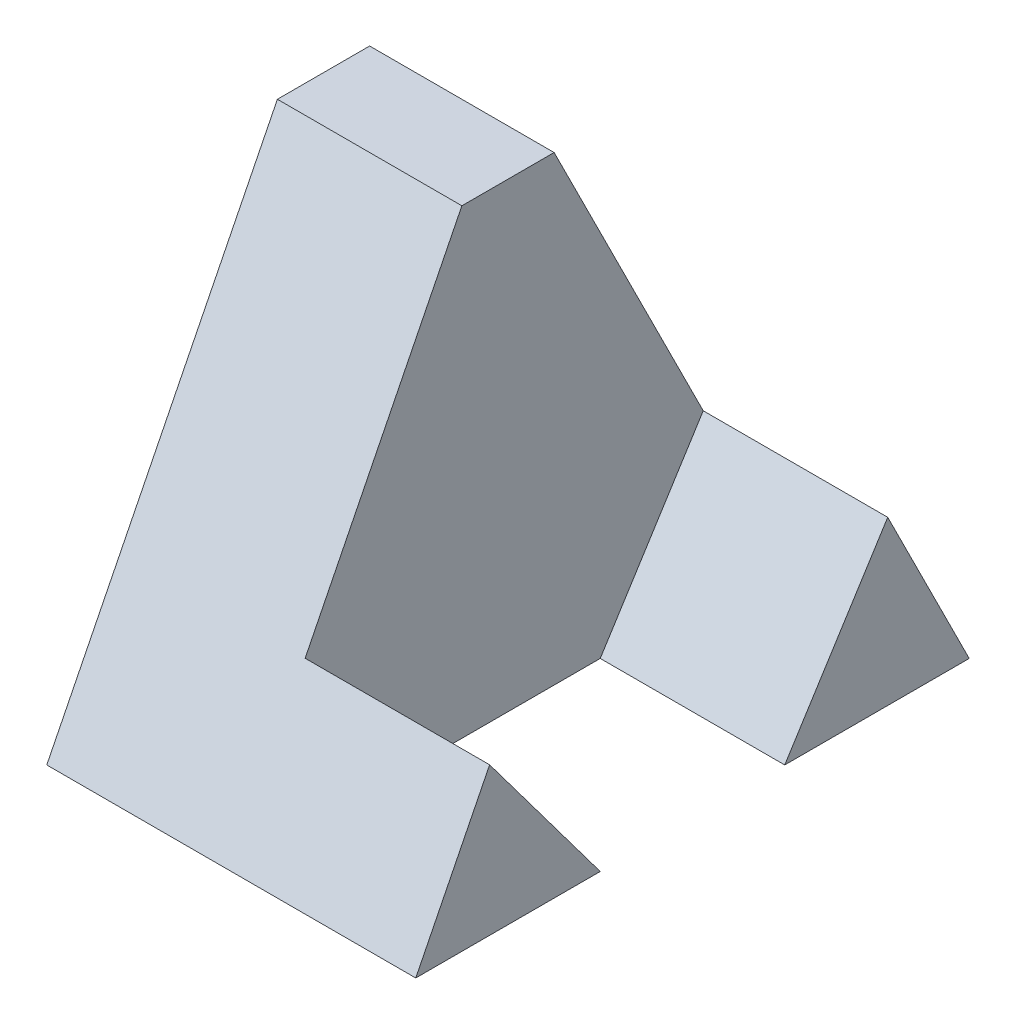
ISO-10303-21;
HEADER;
FILE_DESCRIPTION(('STEP AP214'),'2;1');
FILE_NAME('part.step','',(''),(''),'','','');
FILE_SCHEMA(('AUTOMOTIVE_DESIGN { 1 0 10303 214 1 1 1 1 }'));
ENDSEC;
DATA;
#1=APPLICATION_CONTEXT('core data for automotive mechanical design processes');
#2=APPLICATION_PROTOCOL_DEFINITION('international standard','automotive_design',2000,#1);
#3=PRODUCT_CONTEXT('',#1,'mechanical');
#4=PRODUCT('Part','Part','',(#3));
#5=PRODUCT_RELATED_PRODUCT_CATEGORY('part','',(#4));
#6=PRODUCT_DEFINITION_FORMATION('','',#4);
#7=PRODUCT_DEFINITION_CONTEXT('part definition',#1,'design');
#8=PRODUCT_DEFINITION('design','',#6,#7);
#9=PRODUCT_DEFINITION_SHAPE('','',#8);
#10=(LENGTH_UNIT() NAMED_UNIT(*) SI_UNIT(.MILLI.,.METRE.));
#11=(NAMED_UNIT(*) PLANE_ANGLE_UNIT() SI_UNIT($,.RADIAN.));
#12=(NAMED_UNIT(*) SI_UNIT($,.STERADIAN.) SOLID_ANGLE_UNIT());
#13=UNCERTAINTY_MEASURE_WITH_UNIT(LENGTH_MEASURE(1.E-05),#10,'distance_accuracy_value','');
#14=(GEOMETRIC_REPRESENTATION_CONTEXT(3) GLOBAL_UNCERTAINTY_ASSIGNED_CONTEXT((#13)) GLOBAL_UNIT_ASSIGNED_CONTEXT((#10,
#11,#12)) REPRESENTATION_CONTEXT('',''));
#15=CARTESIAN_POINT('',(0.,0.,0.));
#16=DIRECTION('',(0.,0.,1.));
#17=DIRECTION('',(1.,0.,0.));
#18=AXIS2_PLACEMENT_3D('',#15,#16,#17);
#19=CARTESIAN_POINT('',(2.,0.,0.));
#20=DIRECTION('',(-1.,0.,0.));
#21=DIRECTION('',(0.,0.,1.));
#22=AXIS2_PLACEMENT_3D('',#19,#20,#21);
#23=PLANE('',#22);
#24=DIRECTION('',(0.,-0.845444264272586,0.534063662879797));
#25=VECTOR('',#24,1.);
#26=CARTESIAN_POINT('',(2.,1.76725923122295,-5.11637038438853));
#27=LINE('',#26,#25);
#28=CARTESIAN_POINT('',(2.,1.76725923122295,-5.11637038438853));
#29=VERTEX_POINT('',#28);
#30=CARTESIAN_POINT('',(2.,0.,-4.));
#31=VERTEX_POINT('',#30);
#32=EDGE_CURVE('E114',#29,#31,#27,.T.);
#33=ORIENTED_EDGE('',*,*,#32,.F.);
#34=DIRECTION('',(0.,0.894427190999916,0.447213595499958));
#35=VECTOR('',#34,1.);
#36=CARTESIAN_POINT('',(2.,5.,-3.5));
#37=LINE('',#36,#35);
#38=CARTESIAN_POINT('',(2.,5.,-3.5));
#39=VERTEX_POINT('',#38);
#40=EDGE_CURVE('E167',#29,#39,#37,.T.);
#41=ORIENTED_EDGE('',*,*,#40,.T.);
#42=DIRECTION('',(0.,0.,1.));
#43=VECTOR('',#42,1.);
#44=CARTESIAN_POINT('',(2.,5.,-2.5));
#45=LINE('',#44,#43);
#46=CARTESIAN_POINT('',(2.,5.,-2.5));
#47=VERTEX_POINT('',#46);
#48=EDGE_CURVE('E168',#39,#47,#45,.T.);
#49=ORIENTED_EDGE('',*,*,#48,.T.);
#50=DIRECTION('',(0.,-0.894427190999916,0.447213595499958));
#51=VECTOR('',#50,1.);
#52=CARTESIAN_POINT('',(2.,0.,0.));
#53=LINE('',#52,#51);
#54=CARTESIAN_POINT('',(2.,1.6014201669053,-0.80071008345265));
#55=VERTEX_POINT('',#54);
#56=EDGE_CURVE('E137',#47,#55,#53,.T.);
#57=ORIENTED_EDGE('',*,*,#56,.T.);
#58=DIRECTION('',(0.,0.800425697208238,0.599431983838623));
#59=VECTOR('',#58,1.);
#60=CARTESIAN_POINT('',(2.,0.,-2.));
#61=LINE('',#60,#59);
#62=CARTESIAN_POINT('',(2.,0.,-2.));
#63=VERTEX_POINT('',#62);
#64=EDGE_CURVE('E55',#63,#55,#61,.T.);
#65=ORIENTED_EDGE('',*,*,#64,.F.);
#66=DIRECTION('',(0.,0.,-1.));
#67=VECTOR('',#66,1.);
#68=CARTESIAN_POINT('',(2.,0.,-6.));
#69=LINE('',#68,#67);
#70=EDGE_CURVE('E50',#63,#31,#69,.T.);
#71=ORIENTED_EDGE('',*,*,#70,.T.);
#72=EDGE_LOOP('',(#33,#41,#49,#57,#65,#71));
#73=FACE_BOUND('',#72,.T.);
#74=ADVANCED_FACE('F33',(#73),#23,.F.);
#75=CARTESIAN_POINT('',(2.,0.,-6.));
#76=DIRECTION('',(0.,1.,0.));
#77=DIRECTION('',(0.,0.,1.));
#78=AXIS2_PLACEMENT_3D('',#75,#76,#77);
#79=PLANE('',#78);
#80=DIRECTION('',(0.,0.,-1.));
#81=VECTOR('',#80,1.);
#82=CARTESIAN_POINT('',(0.,0.,-6.));
#83=LINE('',#82,#81);
#84=CARTESIAN_POINT('',(0.,0.,0.));
#85=VERTEX_POINT('',#84);
#86=CARTESIAN_POINT('',(0.,0.,-6.));
#87=VERTEX_POINT('',#86);
#88=EDGE_CURVE('E145',#85,#87,#83,.T.);
#89=ORIENTED_EDGE('',*,*,#88,.T.);
#90=DIRECTION('',(-1.,0.,0.));
#91=VECTOR('',#90,1.);
#92=CARTESIAN_POINT('',(2.,0.,-6.));
#93=LINE('',#92,#91);
#94=CARTESIAN_POINT('',(4.,0.,-6.));
#95=VERTEX_POINT('',#94);
#96=EDGE_CURVE('E11',#95,#87,#93,.T.);
#97=ORIENTED_EDGE('',*,*,#96,.F.);
#98=DIRECTION('',(0.,0.,-1.));
#99=VECTOR('',#98,1.);
#100=CARTESIAN_POINT('',(4.,0.,-4.));
#101=LINE('',#100,#99);
#102=CARTESIAN_POINT('',(4.,0.,-4.));
#103=VERTEX_POINT('',#102);
#104=EDGE_CURVE('E98',#103,#95,#101,.T.);
#105=ORIENTED_EDGE('',*,*,#104,.F.);
#106=DIRECTION('',(-1.,0.,0.));
#107=VECTOR('',#106,1.);
#108=CARTESIAN_POINT('',(4.,0.,-4.));
#109=LINE('',#108,#107);
#110=EDGE_CURVE('E102',#103,#31,#109,.T.);
#111=ORIENTED_EDGE('',*,*,#110,.T.);
#112=ORIENTED_EDGE('',*,*,#70,.F.);
#113=DIRECTION('',(-1.,0.,0.));
#114=VECTOR('',#113,1.);
#115=CARTESIAN_POINT('',(4.,0.,-2.));
#116=LINE('',#115,#114);
#117=CARTESIAN_POINT('',(4.,0.,-2.));
#118=VERTEX_POINT('',#117);
#119=EDGE_CURVE('E142',#118,#63,#116,.T.);
#120=ORIENTED_EDGE('',*,*,#119,.F.);
#121=DIRECTION('',(0.,0.,-1.));
#122=VECTOR('',#121,1.);
#123=CARTESIAN_POINT('',(4.,0.,0.));
#124=LINE('',#123,#122);
#125=CARTESIAN_POINT('',(4.,0.,0.));
#126=VERTEX_POINT('',#125);
#127=EDGE_CURVE('E126',#126,#118,#124,.T.);
#128=ORIENTED_EDGE('',*,*,#127,.F.);
#129=DIRECTION('',(-1.,0.,0.));
#130=VECTOR('',#129,1.);
#131=CARTESIAN_POINT('',(2.,0.,0.));
#132=LINE('',#131,#130);
#133=EDGE_CURVE('E161',#126,#85,#132,.T.);
#134=ORIENTED_EDGE('',*,*,#133,.T.);
#135=EDGE_LOOP('',(#89,#97,#105,#111,#112,#120,#128,#134));
#136=FACE_BOUND('',#135,.T.);
#137=ADVANCED_FACE('F35',(#136),#79,.F.);
#138=CARTESIAN_POINT('',(2.,5.,-3.5));
#139=DIRECTION('',(0.,-0.447213595499958,0.894427190999916));
#140=DIRECTION('',(0.,-0.894427190999916,-0.447213595499958));
#141=AXIS2_PLACEMENT_3D('',#138,#139,#140);
#142=PLANE('',#141);
#143=DIRECTION('',(0.,0.894427190999916,0.447213595499958));
#144=VECTOR('',#143,1.);
#145=CARTESIAN_POINT('',(0.,5.,-3.5));
#146=LINE('',#145,#144);
#147=CARTESIAN_POINT('',(0.,5.,-3.5));
#148=VERTEX_POINT('',#147);
#149=EDGE_CURVE('E149',#87,#148,#146,.T.);
#150=ORIENTED_EDGE('',*,*,#149,.T.);
#151=DIRECTION('',(-1.,0.,0.));
#152=VECTOR('',#151,1.);
#153=CARTESIAN_POINT('',(2.,5.,-3.5));
#154=LINE('',#153,#152);
#155=EDGE_CURVE('E42',#39,#148,#154,.T.);
#156=ORIENTED_EDGE('',*,*,#155,.F.);
#157=ORIENTED_EDGE('',*,*,#40,.F.);
#158=DIRECTION('',(-1.,0.,0.));
#159=VECTOR('',#158,1.);
#160=CARTESIAN_POINT('',(4.,1.76725923122295,-5.11637038438853));
#161=LINE('',#160,#159);
#162=CARTESIAN_POINT('',(4.,1.76725923122295,-5.11637038438853));
#163=VERTEX_POINT('',#162);
#164=EDGE_CURVE('E117',#163,#29,#161,.T.);
#165=ORIENTED_EDGE('',*,*,#164,.F.);
#166=DIRECTION('',(0.,0.894427190999916,0.447213595499958));
#167=VECTOR('',#166,1.);
#168=CARTESIAN_POINT('',(4.,0.,-6.));
#169=LINE('',#168,#167);
#170=EDGE_CURVE('E106',#95,#163,#169,.T.);
#171=ORIENTED_EDGE('',*,*,#170,.F.);
#172=ORIENTED_EDGE('',*,*,#96,.T.);
#173=EDGE_LOOP('',(#150,#156,#157,#165,#171,#172));
#174=FACE_BOUND('',#173,.T.);
#175=ADVANCED_FACE('F186',(#174),#142,.F.);
#176=CARTESIAN_POINT('',(2.,5.,-2.5));
#177=DIRECTION('',(0.,-1.,0.));
#178=DIRECTION('',(0.,0.,-1.));
#179=AXIS2_PLACEMENT_3D('',#176,#177,#178);
#180=PLANE('',#179);
#181=DIRECTION('',(0.,0.,1.));
#182=VECTOR('',#181,1.);
#183=CARTESIAN_POINT('',(0.,5.,-2.5));
#184=LINE('',#183,#182);
#185=CARTESIAN_POINT('',(0.,5.,-2.5));
#186=VERTEX_POINT('',#185);
#187=EDGE_CURVE('E153',#148,#186,#184,.T.);
#188=ORIENTED_EDGE('',*,*,#187,.T.);
#189=DIRECTION('',(-1.,0.,0.));
#190=VECTOR('',#189,1.);
#191=CARTESIAN_POINT('',(2.,5.,-2.5));
#192=LINE('',#191,#190);
#193=EDGE_CURVE('E163',#47,#186,#192,.T.);
#194=ORIENTED_EDGE('',*,*,#193,.F.);
#195=ORIENTED_EDGE('',*,*,#48,.F.);
#196=ORIENTED_EDGE('',*,*,#155,.T.);
#197=EDGE_LOOP('',(#188,#194,#195,#196));
#198=FACE_BOUND('',#197,.T.);
#199=ADVANCED_FACE('F189',(#198),#180,.F.);
#200=CARTESIAN_POINT('',(2.,0.,0.));
#201=DIRECTION('',(0.,-0.447213595499958,-0.894427190999916));
#202=DIRECTION('',(0.,0.894427190999916,-0.447213595499958));
#203=AXIS2_PLACEMENT_3D('',#200,#201,#202);
#204=PLANE('',#203);
#205=DIRECTION('',(0.,-0.894427190999916,0.447213595499958));
#206=VECTOR('',#205,1.);
#207=CARTESIAN_POINT('',(0.,0.,0.));
#208=LINE('',#207,#206);
#209=EDGE_CURVE('E159',#186,#85,#208,.T.);
#210=ORIENTED_EDGE('',*,*,#209,.T.);
#211=ORIENTED_EDGE('',*,*,#133,.F.);
#212=DIRECTION('',(0.,-0.894427190999916,0.447213595499958));
#213=VECTOR('',#212,1.);
#214=CARTESIAN_POINT('',(4.,1.6014201669053,-0.80071008345265));
#215=LINE('',#214,#213);
#216=CARTESIAN_POINT('',(4.,1.6014201669053,-0.80071008345265));
#217=VERTEX_POINT('',#216);
#218=EDGE_CURVE('E119',#217,#126,#215,.T.);
#219=ORIENTED_EDGE('',*,*,#218,.F.);
#220=DIRECTION('',(-1.,0.,0.));
#221=VECTOR('',#220,1.);
#222=CARTESIAN_POINT('',(4.,1.6014201669053,-0.80071008345265));
#223=LINE('',#222,#221);
#224=EDGE_CURVE('E130',#217,#55,#223,.T.);
#225=ORIENTED_EDGE('',*,*,#224,.T.);
#226=ORIENTED_EDGE('',*,*,#56,.F.);
#227=ORIENTED_EDGE('',*,*,#193,.T.);
#228=EDGE_LOOP('',(#210,#211,#219,#225,#226,#227));
#229=FACE_BOUND('',#228,.T.);
#230=ADVANCED_FACE('F177',(#229),#204,.F.);
#231=CARTESIAN_POINT('',(0.,0.,0.));
#232=DIRECTION('',(-1.,0.,0.));
#233=DIRECTION('',(0.,0.,1.));
#234=AXIS2_PLACEMENT_3D('',#231,#232,#233);
#235=PLANE('',#234);
#236=ORIENTED_EDGE('',*,*,#88,.F.);
#237=ORIENTED_EDGE('',*,*,#209,.F.);
#238=ORIENTED_EDGE('',*,*,#187,.F.);
#239=ORIENTED_EDGE('',*,*,#149,.F.);
#240=EDGE_LOOP('',(#236,#237,#238,#239));
#241=FACE_BOUND('',#240,.T.);
#242=ADVANCED_FACE('F183',(#241),#235,.T.);
#243=CARTESIAN_POINT('',(4.,0.,-2.));
#244=DIRECTION('',(0.,-0.599431983838623,0.800425697208238));
#245=DIRECTION('',(0.,-0.800425697208238,-0.599431983838623));
#246=AXIS2_PLACEMENT_3D('',#243,#244,#245);
#247=PLANE('',#246);
#248=ORIENTED_EDGE('',*,*,#64,.T.);
#249=ORIENTED_EDGE('',*,*,#224,.F.);
#250=DIRECTION('',(0.,0.800425697208238,0.599431983838623));
#251=VECTOR('',#250,1.);
#252=CARTESIAN_POINT('',(4.,0.,-2.));
#253=LINE('',#252,#251);
#254=EDGE_CURVE('E128',#118,#217,#253,.T.);
#255=ORIENTED_EDGE('',*,*,#254,.F.);
#256=ORIENTED_EDGE('',*,*,#119,.T.);
#257=EDGE_LOOP('',(#248,#249,#255,#256));
#258=FACE_BOUND('',#257,.T.);
#259=ADVANCED_FACE('F175',(#258),#247,.F.);
#260=CARTESIAN_POINT('',(4.,0.,0.));
#261=DIRECTION('',(1.,0.,0.));
#262=DIRECTION('',(0.,0.,-1.));
#263=AXIS2_PLACEMENT_3D('',#260,#261,#262);
#264=PLANE('',#263);
#265=ORIENTED_EDGE('',*,*,#218,.T.);
#266=ORIENTED_EDGE('',*,*,#127,.T.);
#267=ORIENTED_EDGE('',*,*,#254,.T.);
#268=EDGE_LOOP('',(#265,#266,#267));
#269=FACE_BOUND('',#268,.T.);
#270=ADVANCED_FACE('F180',(#269),#264,.T.);
#271=CARTESIAN_POINT('',(4.,1.76725923122295,-5.11637038438853));
#272=DIRECTION('',(0.,-0.534063662879797,-0.845444264272586));
#273=DIRECTION('',(0.,0.845444264272586,-0.534063662879797));
#274=AXIS2_PLACEMENT_3D('',#271,#272,#273);
#275=PLANE('',#274);
#276=ORIENTED_EDGE('',*,*,#32,.T.);
#277=ORIENTED_EDGE('',*,*,#110,.F.);
#278=DIRECTION('',(0.,-0.845444264272586,0.534063662879797));
#279=VECTOR('',#278,1.);
#280=CARTESIAN_POINT('',(4.,1.76725923122295,-5.11637038438853));
#281=LINE('',#280,#279);
#282=EDGE_CURVE('E107',#163,#103,#281,.T.);
#283=ORIENTED_EDGE('',*,*,#282,.F.);
#284=ORIENTED_EDGE('',*,*,#164,.T.);
#285=EDGE_LOOP('',(#276,#277,#283,#284));
#286=FACE_BOUND('',#285,.T.);
#287=ADVANCED_FACE('F116',(#286),#275,.F.);
#288=CARTESIAN_POINT('',(4.,0.,0.));
#289=DIRECTION('',(-1.,0.,0.));
#290=DIRECTION('',(0.,0.,1.));
#291=AXIS2_PLACEMENT_3D('',#288,#289,#290);
#292=PLANE('',#291);
#293=ORIENTED_EDGE('',*,*,#282,.T.);
#294=ORIENTED_EDGE('',*,*,#104,.T.);
#295=ORIENTED_EDGE('',*,*,#170,.T.);
#296=EDGE_LOOP('',(#293,#294,#295));
#297=FACE_BOUND('',#296,.T.);
#298=ADVANCED_FACE('F110',(#297),#292,.F.);
#299=CLOSED_SHELL('',(#74,#137,#175,#199,#230,#242,#259,#270,#287,#298));
#300=MANIFOLD_SOLID_BREP('B2',#299);
#301=ADVANCED_BREP_SHAPE_REPRESENTATION('',(#18,#300),#14);
#302=SHAPE_DEFINITION_REPRESENTATION(#9,#301);
ENDSEC;
END-ISO-10303-21;
